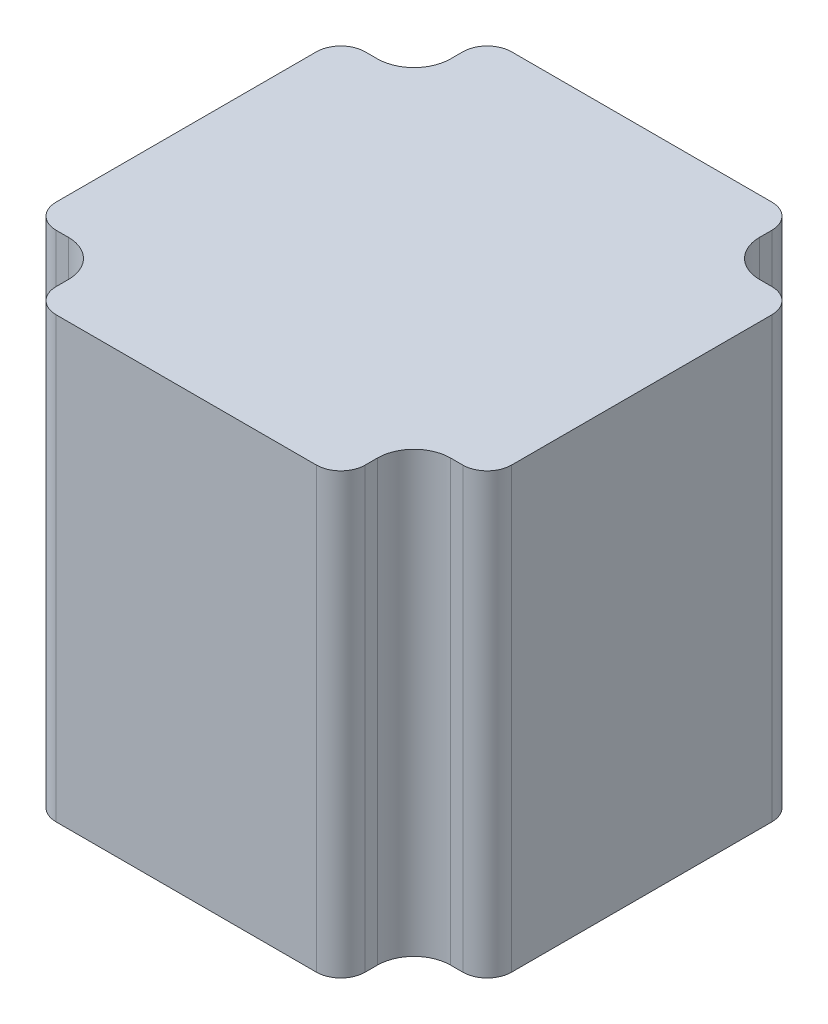
ISO-10303-21;
HEADER;
FILE_DESCRIPTION(('STEP AP214'),'2;1');
FILE_NAME('part.step','',(''),(''),'','','');
FILE_SCHEMA(('AUTOMOTIVE_DESIGN { 1 0 10303 214 1 1 1 1 }'));
ENDSEC;
DATA;
#1=APPLICATION_CONTEXT('core data for automotive mechanical design processes');
#2=APPLICATION_PROTOCOL_DEFINITION('international standard','automotive_design',2000,#1);
#3=PRODUCT_CONTEXT('',#1,'mechanical');
#4=PRODUCT('Part','Part','',(#3));
#5=PRODUCT_RELATED_PRODUCT_CATEGORY('part','',(#4));
#6=PRODUCT_DEFINITION_FORMATION('','',#4);
#7=PRODUCT_DEFINITION_CONTEXT('part definition',#1,'design');
#8=PRODUCT_DEFINITION('design','',#6,#7);
#9=PRODUCT_DEFINITION_SHAPE('','',#8);
#10=(LENGTH_UNIT() NAMED_UNIT(*) SI_UNIT(.MILLI.,.METRE.));
#11=(NAMED_UNIT(*) PLANE_ANGLE_UNIT() SI_UNIT($,.RADIAN.));
#12=(NAMED_UNIT(*) SI_UNIT($,.STERADIAN.) SOLID_ANGLE_UNIT());
#13=UNCERTAINTY_MEASURE_WITH_UNIT(LENGTH_MEASURE(1.E-05),#10,'distance_accuracy_value','');
#14=(GEOMETRIC_REPRESENTATION_CONTEXT(3) GLOBAL_UNCERTAINTY_ASSIGNED_CONTEXT((#13)) GLOBAL_UNIT_ASSIGNED_CONTEXT((#10,
#11,#12)) REPRESENTATION_CONTEXT('',''));
#15=CARTESIAN_POINT('',(0.,0.,0.));
#16=DIRECTION('',(0.,0.,1.));
#17=DIRECTION('',(1.,0.,0.));
#18=AXIS2_PLACEMENT_3D('',#15,#16,#17);
#19=CARTESIAN_POINT('',(81.,-5.6899999999982,69.18));
#20=DIRECTION('',(0.,0.,-1.));
#21=DIRECTION('',(0.,-1.,0.));
#22=AXIS2_PLACEMENT_3D('',#19,#20,#21);
#23=PLANE('',#22);
#24=DIRECTION('',(0.,-1.,0.));
#25=VECTOR('',#24,1.);
#26=CARTESIAN_POINT('',(69.5,17.3100000000018,69.18));
#27=LINE('',#26,#25);
#28=CARTESIAN_POINT('',(69.5,89.2100000000019,69.18));
#29=VERTEX_POINT('',#28);
#30=CARTESIAN_POINT('',(69.5,51.8100000000018,69.18));
#31=VERTEX_POINT('',#30);
#32=EDGE_CURVE('E714',#29,#31,#27,.T.);
#33=ORIENTED_EDGE('',*,*,#32,.F.);
#34=CARTESIAN_POINT('',(69.5000000000001,105.810000000002,69.18));
#35=DIRECTION('',(0.,-1.,0.));
#36=VECTOR('',#35,1.);
#37=LINE('',#34,#36);
#38=CARTESIAN_POINT('',(69.5,105.810000000002,69.18));
#39=VERTEX_POINT('',#38);
#40=EDGE_CURVE('E442',#39,#29,#37,.T.);
#41=ORIENTED_EDGE('',*,*,#40,.F.);
#42=DIRECTION('',(-1.,0.,0.));
#43=VECTOR('',#42,1.);
#44=CARTESIAN_POINT('',(91.25,105.810000000002,69.18));
#45=LINE('',#44,#43);
#46=CARTESIAN_POINT('',(101.5,105.810000000002,69.18));
#47=VERTEX_POINT('',#46);
#48=EDGE_CURVE('E552',#47,#39,#45,.T.);
#49=ORIENTED_EDGE('',*,*,#48,.F.);
#50=CARTESIAN_POINT('',(101.5,105.810000000002,69.1800000000001));
#51=DIRECTION('',(0.,-1.,0.));
#52=VECTOR('',#51,1.);
#53=LINE('',#50,#52);
#54=CARTESIAN_POINT('',(101.5,89.2100000000018,69.18));
#55=VERTEX_POINT('',#54);
#56=EDGE_CURVE('E473',#47,#55,#53,.T.);
#57=ORIENTED_EDGE('',*,*,#56,.T.);
#58=DIRECTION('',(0.,1.,0.));
#59=VECTOR('',#58,1.);
#60=CARTESIAN_POINT('',(101.5,17.3100000000017,69.18));
#61=LINE('',#60,#59);
#62=CARTESIAN_POINT('',(101.5,51.8100000000017,69.18));
#63=VERTEX_POINT('',#62);
#64=EDGE_CURVE('E718',#63,#55,#61,.T.);
#65=ORIENTED_EDGE('',*,*,#64,.F.);
#66=DIRECTION('',(1.,0.,0.));
#67=VECTOR('',#66,1.);
#68=CARTESIAN_POINT('',(91.25,51.8100000000018,69.18));
#69=LINE('',#68,#67);
#70=EDGE_CURVE('E143',#31,#63,#69,.T.);
#71=ORIENTED_EDGE('',*,*,#70,.F.);
#72=EDGE_LOOP('',(#33,#41,#49,#57,#65,#71));
#73=FACE_BOUND('',#72,.T.);
#74=ADVANCED_FACE('F17',(#73),#23,.T.);
#75=CARTESIAN_POINT('',(104.5,40.3100000000017,122.93));
#76=DIRECTION('',(1.,0.,0.));
#77=DIRECTION('',(0.,1.,0.));
#78=AXIS2_PLACEMENT_3D('',#75,#76,#77);
#79=PLANE('',#78);
#80=DIRECTION('',(0.,-1.,0.));
#81=VECTOR('',#80,1.);
#82=CARTESIAN_POINT('',(104.5,17.3100000000017,72.18));
#83=LINE('',#82,#81);
#84=CARTESIAN_POINT('',(104.5,105.810000000002,72.18));
#85=VERTEX_POINT('',#84);
#86=CARTESIAN_POINT('',(104.5,51.8100000000017,72.18));
#87=VERTEX_POINT('',#86);
#88=EDGE_CURVE('E11',#85,#87,#83,.T.);
#89=ORIENTED_EDGE('',*,*,#88,.F.);
#90=DIRECTION('',(0.,0.,-1.));
#91=VECTOR('',#90,1.);
#92=CARTESIAN_POINT('',(104.5,105.810000000002,122.18));
#93=LINE('',#92,#91);
#94=CARTESIAN_POINT('',(104.5,105.810000000002,73.68));
#95=VERTEX_POINT('',#94);
#96=EDGE_CURVE('E546',#95,#85,#93,.T.);
#97=ORIENTED_EDGE('',*,*,#96,.F.);
#98=DIRECTION('',(0.,1.,0.));
#99=VECTOR('',#98,1.);
#100=CARTESIAN_POINT('',(104.5,40.3100000000017,73.68));
#101=LINE('',#100,#99);
#102=CARTESIAN_POINT('',(104.5,51.8100000000017,73.68));
#103=VERTEX_POINT('',#102);
#104=EDGE_CURVE('E30',#103,#95,#101,.T.);
#105=ORIENTED_EDGE('',*,*,#104,.F.);
#106=DIRECTION('',(0.,0.,1.));
#107=VECTOR('',#106,1.);
#108=CARTESIAN_POINT('',(104.5,51.8100000000017,122.18));
#109=LINE('',#108,#107);
#110=EDGE_CURVE('E126',#87,#103,#109,.T.);
#111=ORIENTED_EDGE('',*,*,#110,.F.);
#112=EDGE_LOOP('',(#89,#97,#105,#111));
#113=FACE_BOUND('',#112,.T.);
#114=ADVANCED_FACE('F385',(#113),#79,.T.);
#115=CARTESIAN_POINT('',(109.,40.3100000000017,73.68));
#116=DIRECTION('',(0.,-1.,0.));
#117=DIRECTION('',(0.,0.,-1.));
#118=AXIS2_PLACEMENT_3D('',#115,#116,#117);
#119=CYLINDRICAL_SURFACE('',#118,4.5);
#120=ORIENTED_EDGE('',*,*,#104,.T.);
#121=CARTESIAN_POINT('',(109.,105.810000000002,73.68));
#122=DIRECTION('',(0.,-1.,0.));
#123=DIRECTION('',(0.,0.,-1.));
#124=AXIS2_PLACEMENT_3D('',#121,#122,#123);
#125=CIRCLE('',#124,4.5);
#126=CARTESIAN_POINT('',(109.,105.810000000002,78.18));
#127=VERTEX_POINT('',#126);
#128=EDGE_CURVE('E543',#127,#95,#125,.T.);
#129=ORIENTED_EDGE('',*,*,#128,.F.);
#130=DIRECTION('',(0.,1.,0.));
#131=VECTOR('',#130,1.);
#132=CARTESIAN_POINT('',(109.,40.3100000000017,78.18));
#133=LINE('',#132,#131);
#134=CARTESIAN_POINT('',(109.,51.8100000000017,78.18));
#135=VERTEX_POINT('',#134);
#136=EDGE_CURVE('E80',#135,#127,#133,.T.);
#137=ORIENTED_EDGE('',*,*,#136,.F.);
#138=CARTESIAN_POINT('',(109.,51.8100000000017,73.68));
#139=DIRECTION('',(0.,1.,0.));
#140=DIRECTION('',(0.,0.,-1.));
#141=AXIS2_PLACEMENT_3D('',#138,#139,#140);
#142=CIRCLE('',#141,4.5);
#143=EDGE_CURVE('E117',#103,#135,#142,.T.);
#144=ORIENTED_EDGE('',*,*,#143,.F.);
#145=EDGE_LOOP('',(#120,#129,#137,#144));
#146=FACE_BOUND('',#145,.T.);
#147=ADVANCED_FACE('F383',(#146),#119,.F.);
#148=CARTESIAN_POINT('',(59.75,40.3100000000019,78.18));
#149=DIRECTION('',(0.,0.,-1.));
#150=DIRECTION('',(0.,-1.,0.));
#151=AXIS2_PLACEMENT_3D('',#148,#149,#150);
#152=PLANE('',#151);
#153=ORIENTED_EDGE('',*,*,#136,.T.);
#154=DIRECTION('',(-1.,0.,0.));
#155=VECTOR('',#154,1.);
#156=CARTESIAN_POINT('',(101.5,105.810000000002,78.18));
#157=LINE('',#156,#155);
#158=CARTESIAN_POINT('',(110.5,105.810000000002,78.18));
#159=VERTEX_POINT('',#158);
#160=EDGE_CURVE('E111',#159,#127,#157,.T.);
#161=ORIENTED_EDGE('',*,*,#160,.F.);
#162=DIRECTION('',(0.,1.,0.));
#163=VECTOR('',#162,1.);
#164=CARTESIAN_POINT('',(110.5,55.3100000000017,78.18));
#165=LINE('',#164,#163);
#166=CARTESIAN_POINT('',(110.5,51.8100000000017,78.18));
#167=VERTEX_POINT('',#166);
#168=EDGE_CURVE('E93',#167,#159,#165,.T.);
#169=ORIENTED_EDGE('',*,*,#168,.F.);
#170=DIRECTION('',(1.,0.,0.));
#171=VECTOR('',#170,1.);
#172=CARTESIAN_POINT('',(101.5,51.8100000000017,78.18));
#173=LINE('',#172,#171);
#174=EDGE_CURVE('E108',#135,#167,#173,.T.);
#175=ORIENTED_EDGE('',*,*,#174,.F.);
#176=EDGE_LOOP('',(#153,#161,#169,#175));
#177=FACE_BOUND('',#176,.T.);
#178=ADVANCED_FACE('F107',(#177),#152,.T.);
#179=CARTESIAN_POINT('',(113.5,70.3100000000017,125.18));
#180=DIRECTION('',(1.,0.,0.));
#181=DIRECTION('',(0.,-1.,0.));
#182=AXIS2_PLACEMENT_3D('',#179,#180,#181);
#183=PLANE('',#182);
#184=DIRECTION('',(0.,-1.,0.));
#185=VECTOR('',#184,1.);
#186=CARTESIAN_POINT('',(113.5,55.3100000000017,81.18));
#187=LINE('',#186,#185);
#188=CARTESIAN_POINT('',(113.5,89.2100000000017,81.18));
#189=VERTEX_POINT('',#188);
#190=CARTESIAN_POINT('',(113.5,51.8100000000017,81.18));
#191=VERTEX_POINT('',#190);
#192=EDGE_CURVE('E98',#189,#191,#187,.T.);
#193=ORIENTED_EDGE('',*,*,#192,.F.);
#194=CARTESIAN_POINT('',(113.5,105.810000000002,81.18));
#195=DIRECTION('',(0.,-1.,0.));
#196=VECTOR('',#195,1.);
#197=LINE('',#194,#196);
#198=CARTESIAN_POINT('',(113.5,105.810000000002,81.18));
#199=VERTEX_POINT('',#198);
#200=EDGE_CURVE('E762',#199,#189,#197,.T.);
#201=ORIENTED_EDGE('',*,*,#200,.F.);
#202=DIRECTION('',(0.,0.,-1.));
#203=VECTOR('',#202,1.);
#204=CARTESIAN_POINT('',(113.5,105.810000000002,123.68));
#205=LINE('',#204,#203);
#206=CARTESIAN_POINT('',(113.5,105.810000000002,113.18));
#207=VERTEX_POINT('',#206);
#208=EDGE_CURVE('E531',#207,#199,#205,.T.);
#209=ORIENTED_EDGE('',*,*,#208,.F.);
#210=CARTESIAN_POINT('',(113.5,105.810000000002,113.18));
#211=DIRECTION('',(0.,-1.,0.));
#212=VECTOR('',#211,1.);
#213=LINE('',#210,#212);
#214=CARTESIAN_POINT('',(113.5,89.2100000000017,113.18));
#215=VERTEX_POINT('',#214);
#216=EDGE_CURVE('E763',#207,#215,#213,.T.);
#217=ORIENTED_EDGE('',*,*,#216,.T.);
#218=DIRECTION('',(0.,1.,0.));
#219=VECTOR('',#218,1.);
#220=CARTESIAN_POINT('',(113.5,55.3100000000017,113.18));
#221=LINE('',#220,#219);
#222=CARTESIAN_POINT('',(113.5,51.8100000000017,113.18));
#223=VERTEX_POINT('',#222);
#224=EDGE_CURVE('E891',#223,#215,#221,.T.);
#225=ORIENTED_EDGE('',*,*,#224,.F.);
#226=DIRECTION('',(0.,0.,1.));
#227=VECTOR('',#226,1.);
#228=CARTESIAN_POINT('',(113.5,51.8100000000017,123.68));
#229=LINE('',#228,#227);
#230=EDGE_CURVE('E119',#191,#223,#229,.T.);
#231=ORIENTED_EDGE('',*,*,#230,.F.);
#232=EDGE_LOOP('',(#193,#201,#209,#217,#225,#231));
#233=FACE_BOUND('',#232,.T.);
#234=ADVANCED_FACE('F382',(#233),#183,.T.);
#235=CARTESIAN_POINT('',(59.75,40.3100000000019,116.18));
#236=DIRECTION('',(0.,0.,1.));
#237=DIRECTION('',(0.,1.,0.));
#238=AXIS2_PLACEMENT_3D('',#235,#236,#237);
#239=PLANE('',#238);
#240=DIRECTION('',(0.,-1.,0.));
#241=VECTOR('',#240,1.);
#242=CARTESIAN_POINT('',(110.5,55.3100000000017,116.18));
#243=LINE('',#242,#241);
#244=CARTESIAN_POINT('',(110.5,105.810000000002,116.18));
#245=VERTEX_POINT('',#244);
#246=CARTESIAN_POINT('',(110.5,51.8100000000017,116.18));
#247=VERTEX_POINT('',#246);
#248=EDGE_CURVE('E112',#245,#247,#243,.T.);
#249=ORIENTED_EDGE('',*,*,#248,.F.);
#250=DIRECTION('',(1.,0.,0.));
#251=VECTOR('',#250,1.);
#252=CARTESIAN_POINT('',(101.5,105.810000000002,116.18));
#253=LINE('',#252,#251);
#254=CARTESIAN_POINT('',(109.,105.810000000002,116.18));
#255=VERTEX_POINT('',#254);
#256=EDGE_CURVE('E523',#255,#245,#253,.T.);
#257=ORIENTED_EDGE('',*,*,#256,.F.);
#258=DIRECTION('',(0.,1.,0.));
#259=VECTOR('',#258,1.);
#260=CARTESIAN_POINT('',(109.,40.3100000000017,116.18));
#261=LINE('',#260,#259);
#262=CARTESIAN_POINT('',(109.,51.8100000000017,116.18));
#263=VERTEX_POINT('',#262);
#264=EDGE_CURVE('E132',#263,#255,#261,.T.);
#265=ORIENTED_EDGE('',*,*,#264,.F.);
#266=DIRECTION('',(-1.,0.,0.));
#267=VECTOR('',#266,1.);
#268=CARTESIAN_POINT('',(101.5,51.8100000000017,116.18));
#269=LINE('',#268,#267);
#270=EDGE_CURVE('E124',#247,#263,#269,.T.);
#271=ORIENTED_EDGE('',*,*,#270,.F.);
#272=EDGE_LOOP('',(#249,#257,#265,#271));
#273=FACE_BOUND('',#272,.T.);
#274=ADVANCED_FACE('F868',(#273),#239,.T.);
#275=CARTESIAN_POINT('',(109.,40.3100000000017,120.68));
#276=DIRECTION('',(0.,-1.,0.));
#277=DIRECTION('',(1.,0.,0.));
#278=AXIS2_PLACEMENT_3D('',#275,#276,#277);
#279=CYLINDRICAL_SURFACE('',#278,4.5);
#280=ORIENTED_EDGE('',*,*,#264,.T.);
#281=CARTESIAN_POINT('',(109.,105.810000000002,120.68));
#282=DIRECTION('',(0.,-1.,0.));
#283=DIRECTION('',(1.,0.,0.));
#284=AXIS2_PLACEMENT_3D('',#281,#282,#283);
#285=CIRCLE('',#284,4.5);
#286=CARTESIAN_POINT('',(104.5,105.810000000002,120.68));
#287=VERTEX_POINT('',#286);
#288=EDGE_CURVE('E518',#287,#255,#285,.T.);
#289=ORIENTED_EDGE('',*,*,#288,.F.);
#290=CARTESIAN_POINT('',(104.5,105.810000000002,120.68));
#291=DIRECTION('',(0.,-1.,0.));
#292=VECTOR('',#291,1.);
#293=LINE('',#290,#292);
#294=CARTESIAN_POINT('',(104.5,89.2100000000017,120.68));
#295=VERTEX_POINT('',#294);
#296=EDGE_CURVE('E841',#287,#295,#293,.T.);
#297=ORIENTED_EDGE('',*,*,#296,.T.);
#298=DIRECTION('',(0.,1.,0.));
#299=VECTOR('',#298,1.);
#300=CARTESIAN_POINT('',(104.5,40.3100000000017,120.68));
#301=LINE('',#300,#299);
#302=CARTESIAN_POINT('',(104.5,51.8100000000017,120.68));
#303=VERTEX_POINT('',#302);
#304=EDGE_CURVE('E43',#303,#295,#301,.T.);
#305=ORIENTED_EDGE('',*,*,#304,.F.);
#306=CARTESIAN_POINT('',(109.,51.8100000000017,120.68));
#307=DIRECTION('',(0.,1.,0.));
#308=DIRECTION('',(1.,0.,0.));
#309=AXIS2_PLACEMENT_3D('',#306,#307,#308);
#310=CIRCLE('',#309,4.5);
#311=EDGE_CURVE('E138',#263,#303,#310,.T.);
#312=ORIENTED_EDGE('',*,*,#311,.F.);
#313=EDGE_LOOP('',(#280,#289,#297,#305,#312));
#314=FACE_BOUND('',#313,.T.);
#315=ADVANCED_FACE('F801',(#314),#279,.F.);
#316=ORIENTED_EDGE('',*,*,#304,.T.);
#317=ORIENTED_EDGE('',*,*,#296,.F.);
#318=DIRECTION('',(0.,0.,-1.));
#319=VECTOR('',#318,1.);
#320=CARTESIAN_POINT('',(104.5,105.810000000002,122.555));
#321=LINE('',#320,#319);
#322=CARTESIAN_POINT('',(104.5,105.810000000002,122.18));
#323=VERTEX_POINT('',#322);
#324=EDGE_CURVE('E510',#323,#287,#321,.T.);
#325=ORIENTED_EDGE('',*,*,#324,.F.);
#326=CARTESIAN_POINT('',(104.5,105.810000000002,122.18));
#327=DIRECTION('',(0.,-1.,0.));
#328=VECTOR('',#327,1.);
#329=LINE('',#326,#328);
#330=CARTESIAN_POINT('',(104.5,89.2100000000017,122.18));
#331=VERTEX_POINT('',#330);
#332=EDGE_CURVE('E816',#323,#331,#329,.T.);
#333=ORIENTED_EDGE('',*,*,#332,.T.);
#334=DIRECTION('',(0.,1.,0.));
#335=VECTOR('',#334,1.);
#336=CARTESIAN_POINT('',(104.5,17.3100000000017,122.18));
#337=LINE('',#336,#335);
#338=CARTESIAN_POINT('',(104.5,51.8100000000017,122.18));
#339=VERTEX_POINT('',#338);
#340=EDGE_CURVE('E736',#339,#331,#337,.T.);
#341=ORIENTED_EDGE('',*,*,#340,.F.);
#342=DIRECTION('',(0.,0.,1.));
#343=VECTOR('',#342,1.);
#344=CARTESIAN_POINT('',(104.5,51.8100000000017,122.555));
#345=LINE('',#344,#343);
#346=EDGE_CURVE('E1026',#303,#339,#345,.T.);
#347=ORIENTED_EDGE('',*,*,#346,.F.);
#348=EDGE_LOOP('',(#316,#317,#325,#333,#341,#347));
#349=FACE_BOUND('',#348,.T.);
#350=ADVANCED_FACE('F1044',(#349),#79,.T.);
#351=CARTESIAN_POINT('',(101.5,51.8100000000017,122.18));
#352=DIRECTION('',(0.,1.,0.));
#353=DIRECTION('',(0.707106781186541,0.,0.707106781186554));
#354=AXIS2_PLACEMENT_3D('',#351,#352,#353);
#355=PLANE('',#354);
#356=CARTESIAN_POINT('',(69.5,51.8100000000018,122.18));
#357=DIRECTION('',(0.,-1.,0.));
#358=DIRECTION('',(-0.707106781186551,0.,0.707106781186544));
#359=AXIS2_PLACEMENT_3D('',#356,#357,#358);
#360=CIRCLE('',#359,3.);
#361=CARTESIAN_POINT('',(69.5,51.8100000000018,125.18));
#362=VERTEX_POINT('',#361);
#363=CARTESIAN_POINT('',(66.5,51.8100000000019,122.18));
#364=VERTEX_POINT('',#363);
#365=EDGE_CURVE('E638',#362,#364,#360,.T.);
#366=ORIENTED_EDGE('',*,*,#365,.T.);
#367=DIRECTION('',(0.,0.,-1.));
#368=VECTOR('',#367,1.);
#369=CARTESIAN_POINT('',(66.5,51.8100000000019,122.555));
#370=LINE('',#369,#368);
#371=CARTESIAN_POINT('',(66.5,51.8100000000018,120.68));
#372=VERTEX_POINT('',#371);
#373=EDGE_CURVE('E632',#364,#372,#370,.T.);
#374=ORIENTED_EDGE('',*,*,#373,.T.);
#375=CARTESIAN_POINT('',(62.,51.8100000000019,120.68));
#376=DIRECTION('',(0.,1.,0.));
#377=DIRECTION('',(0.,0.,1.));
#378=AXIS2_PLACEMENT_3D('',#375,#376,#377);
#379=CIRCLE('',#378,4.5);
#380=CARTESIAN_POINT('',(62.,51.8100000000019,116.18));
#381=VERTEX_POINT('',#380);
#382=EDGE_CURVE('E612',#372,#381,#379,.T.);
#383=ORIENTED_EDGE('',*,*,#382,.T.);
#384=DIRECTION('',(-1.,0.,0.));
#385=VECTOR('',#384,1.);
#386=CARTESIAN_POINT('',(80.625,51.8100000000018,116.18));
#387=LINE('',#386,#385);
#388=CARTESIAN_POINT('',(60.5,51.8100000000019,116.18));
#389=VERTEX_POINT('',#388);
#390=EDGE_CURVE('E624',#381,#389,#387,.T.);
#391=ORIENTED_EDGE('',*,*,#390,.T.);
#392=CARTESIAN_POINT('',(60.5,51.8100000000019,113.18));
#393=DIRECTION('',(0.,-1.,0.));
#394=DIRECTION('',(-0.707106781186554,0.,0.707106781186541));
#395=AXIS2_PLACEMENT_3D('',#392,#393,#394);
#396=CIRCLE('',#395,3.);
#397=CARTESIAN_POINT('',(57.5,51.8100000000019,113.18));
#398=VERTEX_POINT('',#397);
#399=EDGE_CURVE('E613',#389,#398,#396,.T.);
#400=ORIENTED_EDGE('',*,*,#399,.T.);
#401=DIRECTION('',(0.,0.,-1.));
#402=VECTOR('',#401,1.);
#403=CARTESIAN_POINT('',(57.5,51.8100000000019,123.68));
#404=LINE('',#403,#402);
#405=CARTESIAN_POINT('',(57.5,51.8100000000019,81.18));
#406=VERTEX_POINT('',#405);
#407=EDGE_CURVE('E631',#398,#406,#404,.T.);
#408=ORIENTED_EDGE('',*,*,#407,.T.);
#409=CARTESIAN_POINT('',(60.5,51.8100000000019,81.18));
#410=DIRECTION('',(0.,-1.,0.));
#411=DIRECTION('',(-0.707106781186539,0.,-0.707106781186556));
#412=AXIS2_PLACEMENT_3D('',#409,#410,#411);
#413=CIRCLE('',#412,3.);
#414=CARTESIAN_POINT('',(60.5,51.8100000000019,78.18));
#415=VERTEX_POINT('',#414);
#416=EDGE_CURVE('E639',#406,#415,#413,.T.);
#417=ORIENTED_EDGE('',*,*,#416,.T.);
#418=DIRECTION('',(1.,0.,0.));
#419=VECTOR('',#418,1.);
#420=CARTESIAN_POINT('',(80.625,51.8100000000018,78.18));
#421=LINE('',#420,#419);
#422=CARTESIAN_POINT('',(62.,51.8100000000019,78.18));
#423=VERTEX_POINT('',#422);
#424=EDGE_CURVE('E151',#415,#423,#421,.T.);
#425=ORIENTED_EDGE('',*,*,#424,.T.);
#426=CARTESIAN_POINT('',(62.,51.8100000000019,73.68));
#427=DIRECTION('',(0.,1.,0.));
#428=DIRECTION('',(-1.,0.,0.));
#429=AXIS2_PLACEMENT_3D('',#426,#427,#428);
#430=CIRCLE('',#429,4.5);
#431=CARTESIAN_POINT('',(66.5,51.8100000000019,73.68));
#432=VERTEX_POINT('',#431);
#433=EDGE_CURVE('E147',#423,#432,#430,.T.);
#434=ORIENTED_EDGE('',*,*,#433,.T.);
#435=DIRECTION('',(0.,0.,-1.));
#436=VECTOR('',#435,1.);
#437=CARTESIAN_POINT('',(66.5,51.8100000000018,122.18));
#438=LINE('',#437,#436);
#439=CARTESIAN_POINT('',(66.5,51.8100000000019,72.18));
#440=VERTEX_POINT('',#439);
#441=EDGE_CURVE('E139',#432,#440,#438,.T.);
#442=ORIENTED_EDGE('',*,*,#441,.T.);
#443=CARTESIAN_POINT('',(69.5,51.8100000000018,72.18));
#444=DIRECTION('',(0.,-1.,0.));
#445=DIRECTION('',(-0.707106781186544,0.,-0.707106781186551));
#446=AXIS2_PLACEMENT_3D('',#443,#444,#445);
#447=CIRCLE('',#446,3.);
#448=EDGE_CURVE('E696',#440,#31,#447,.T.);
#449=ORIENTED_EDGE('',*,*,#448,.T.);
#450=ORIENTED_EDGE('',*,*,#70,.T.);
#451=CARTESIAN_POINT('',(101.5,51.8100000000017,72.18));
#452=DIRECTION('',(0.,-1.,0.));
#453=DIRECTION('',(0.707106781186551,0.,-0.707106781186544));
#454=AXIS2_PLACEMENT_3D('',#451,#452,#453);
#455=CIRCLE('',#454,3.);
#456=EDGE_CURVE('E715',#63,#87,#455,.T.);
#457=ORIENTED_EDGE('',*,*,#456,.T.);
#458=ORIENTED_EDGE('',*,*,#110,.T.);
#459=ORIENTED_EDGE('',*,*,#143,.T.);
#460=ORIENTED_EDGE('',*,*,#174,.T.);
#461=CARTESIAN_POINT('',(110.5,51.8100000000017,81.18));
#462=DIRECTION('',(0.,-1.,0.));
#463=DIRECTION('',(0.707106781186557,0.,-0.707106781186538));
#464=AXIS2_PLACEMENT_3D('',#461,#462,#463);
#465=CIRCLE('',#464,3.);
#466=EDGE_CURVE('E88',#167,#191,#465,.T.);
#467=ORIENTED_EDGE('',*,*,#466,.T.);
#468=ORIENTED_EDGE('',*,*,#230,.T.);
#469=CARTESIAN_POINT('',(110.5,51.8100000000017,113.18));
#470=DIRECTION('',(0.,-1.,0.));
#471=DIRECTION('',(0.707106781186544,0.,0.707106781186551));
#472=AXIS2_PLACEMENT_3D('',#469,#470,#471);
#473=CIRCLE('',#472,3.);
#474=EDGE_CURVE('E103',#223,#247,#473,.T.);
#475=ORIENTED_EDGE('',*,*,#474,.T.);
#476=ORIENTED_EDGE('',*,*,#270,.T.);
#477=ORIENTED_EDGE('',*,*,#311,.T.);
#478=ORIENTED_EDGE('',*,*,#346,.T.);
#479=CARTESIAN_POINT('',(101.5,51.8100000000017,122.18));
#480=DIRECTION('',(0.,-1.,0.));
#481=DIRECTION('',(0.707106781186541,0.,0.707106781186554));
#482=AXIS2_PLACEMENT_3D('',#479,#480,#481);
#483=CIRCLE('',#482,3.);
#484=CARTESIAN_POINT('',(101.5,51.8100000000017,125.18));
#485=VERTEX_POINT('',#484);
#486=EDGE_CURVE('E934',#339,#485,#483,.T.);
#487=ORIENTED_EDGE('',*,*,#486,.T.);
#488=DIRECTION('',(-1.,0.,0.));
#489=VECTOR('',#488,1.);
#490=CARTESIAN_POINT('',(91.25,51.8100000000018,125.18));
#491=LINE('',#490,#489);
#492=EDGE_CURVE('E690',#485,#362,#491,.T.);
#493=ORIENTED_EDGE('',*,*,#492,.T.);
#494=EDGE_LOOP('',(#366,#374,#383,#391,#400,#408,#417,#425,#434,#442,#449,#450,#457,#458,#459,
#460,#467,#468,#475,#476,#477,#478,#487,#493));
#495=FACE_BOUND('',#494,.T.);
#496=ADVANCED_FACE('F115',(#495),#355,.F.);
#497=CARTESIAN_POINT('',(66.5,40.3100000000019,122.93));
#498=DIRECTION('',(-1.,0.,0.));
#499=DIRECTION('',(0.,-1.,0.));
#500=AXIS2_PLACEMENT_3D('',#497,#498,#499);
#501=PLANE('',#500);
#502=DIRECTION('',(0.,1.,0.));
#503=VECTOR('',#502,1.);
#504=CARTESIAN_POINT('',(66.5,40.3100000000019,73.68));
#505=LINE('',#504,#503);
#506=CARTESIAN_POINT('',(66.5,105.810000000002,73.68));
#507=VERTEX_POINT('',#506);
#508=EDGE_CURVE('E148',#432,#507,#505,.T.);
#509=ORIENTED_EDGE('',*,*,#508,.T.);
#510=DIRECTION('',(0.,0.,1.));
#511=VECTOR('',#510,1.);
#512=CARTESIAN_POINT('',(66.5,105.810000000002,122.18));
#513=LINE('',#512,#511);
#514=CARTESIAN_POINT('',(66.5,105.810000000002,72.18));
#515=VERTEX_POINT('',#514);
#516=EDGE_CURVE('E562',#515,#507,#513,.T.);
#517=ORIENTED_EDGE('',*,*,#516,.F.);
#518=DIRECTION('',(0.,1.,0.));
#519=VECTOR('',#518,1.);
#520=CARTESIAN_POINT('',(66.5,17.3100000000018,72.18));
#521=LINE('',#520,#519);
#522=EDGE_CURVE('E144',#440,#515,#521,.T.);
#523=ORIENTED_EDGE('',*,*,#522,.F.);
#524=ORIENTED_EDGE('',*,*,#441,.F.);
#525=EDGE_LOOP('',(#509,#517,#523,#524));
#526=FACE_BOUND('',#525,.T.);
#527=ADVANCED_FACE('F19',(#526),#501,.T.);
#528=CARTESIAN_POINT('',(62.,40.3100000000019,73.68));
#529=DIRECTION('',(0.,-1.,0.));
#530=DIRECTION('',(-1.,0.,0.));
#531=AXIS2_PLACEMENT_3D('',#528,#529,#530);
#532=CYLINDRICAL_SURFACE('',#531,4.5);
#533=DIRECTION('',(0.,1.,0.));
#534=VECTOR('',#533,1.);
#535=CARTESIAN_POINT('',(62.,40.3100000000019,78.18));
#536=LINE('',#535,#534);
#537=CARTESIAN_POINT('',(62.,89.2100000000019,78.18));
#538=VERTEX_POINT('',#537);
#539=EDGE_CURVE('E655',#423,#538,#536,.T.);
#540=ORIENTED_EDGE('',*,*,#539,.T.);
#541=CARTESIAN_POINT('',(62.,105.810000000002,78.18));
#542=DIRECTION('',(0.,-1.,0.));
#543=VECTOR('',#542,1.);
#544=LINE('',#541,#543);
#545=CARTESIAN_POINT('',(62.,105.810000000002,78.18));
#546=VERTEX_POINT('',#545);
#547=EDGE_CURVE('E403',#546,#538,#544,.T.);
#548=ORIENTED_EDGE('',*,*,#547,.F.);
#549=CARTESIAN_POINT('',(62.,105.810000000002,73.68));
#550=DIRECTION('',(0.,-1.,0.));
#551=DIRECTION('',(-1.,0.,0.));
#552=AXIS2_PLACEMENT_3D('',#549,#550,#551);
#553=CIRCLE('',#552,4.5);
#554=EDGE_CURVE('E567',#507,#546,#553,.T.);
#555=ORIENTED_EDGE('',*,*,#554,.F.);
#556=ORIENTED_EDGE('',*,*,#508,.F.);
#557=ORIENTED_EDGE('',*,*,#433,.F.);
#558=EDGE_LOOP('',(#540,#548,#555,#556,#557));
#559=FACE_BOUND('',#558,.T.);
#560=ADVANCED_FACE('F410',(#559),#532,.F.);
#561=DIRECTION('',(0.,-1.,0.));
#562=VECTOR('',#561,1.);
#563=CARTESIAN_POINT('',(60.5,55.3100000000019,78.18));
#564=LINE('',#563,#562);
#565=CARTESIAN_POINT('',(60.5,89.2100000000019,78.18));
#566=VERTEX_POINT('',#565);
#567=EDGE_CURVE('E652',#566,#415,#564,.T.);
#568=ORIENTED_EDGE('',*,*,#567,.F.);
#569=CARTESIAN_POINT('',(60.5000000000001,105.810000000002,78.18));
#570=DIRECTION('',(0.,-1.,0.));
#571=VECTOR('',#570,1.);
#572=LINE('',#569,#571);
#573=CARTESIAN_POINT('',(60.5,105.810000000002,78.18));
#574=VERTEX_POINT('',#573);
#575=EDGE_CURVE('E355',#574,#566,#572,.T.);
#576=ORIENTED_EDGE('',*,*,#575,.F.);
#577=DIRECTION('',(-1.,0.,0.));
#578=VECTOR('',#577,1.);
#579=CARTESIAN_POINT('',(80.625,105.810000000002,78.18));
#580=LINE('',#579,#578);
#581=EDGE_CURVE('E570',#546,#574,#580,.T.);
#582=ORIENTED_EDGE('',*,*,#581,.F.);
#583=ORIENTED_EDGE('',*,*,#547,.T.);
#584=ORIENTED_EDGE('',*,*,#539,.F.);
#585=ORIENTED_EDGE('',*,*,#424,.F.);
#586=EDGE_LOOP('',(#568,#576,#582,#583,#584,#585));
#587=FACE_BOUND('',#586,.T.);
#588=ADVANCED_FACE('F384',(#587),#152,.T.);
#589=CARTESIAN_POINT('',(81.,-5.6899999999982,125.18));
#590=DIRECTION('',(0.,0.,-1.));
#591=DIRECTION('',(0.,-1.,0.));
#592=AXIS2_PLACEMENT_3D('',#589,#590,#591);
#593=PLANE('',#592);
#594=DIRECTION('',(0.,-1.,0.));
#595=VECTOR('',#594,1.);
#596=CARTESIAN_POINT('',(101.5,17.3100000000017,125.18));
#597=LINE('',#596,#595);
#598=CARTESIAN_POINT('',(101.5,89.2100000000017,125.18));
#599=VERTEX_POINT('',#598);
#600=EDGE_CURVE('E656',#599,#485,#597,.T.);
#601=ORIENTED_EDGE('',*,*,#600,.F.);
#602=CARTESIAN_POINT('',(101.5,105.810000000002,125.18));
#603=DIRECTION('',(0.,-1.,0.));
#604=VECTOR('',#603,1.);
#605=LINE('',#602,#604);
#606=CARTESIAN_POINT('',(101.5,105.810000000002,125.18));
#607=VERTEX_POINT('',#606);
#608=EDGE_CURVE('E719',#607,#599,#605,.T.);
#609=ORIENTED_EDGE('',*,*,#608,.F.);
#610=DIRECTION('',(-1.,0.,0.));
#611=VECTOR('',#610,1.);
#612=CARTESIAN_POINT('',(91.25,105.810000000002,125.18));
#613=LINE('',#612,#611);
#614=CARTESIAN_POINT('',(69.5,105.810000000002,125.18));
#615=VERTEX_POINT('',#614);
#616=EDGE_CURVE('E497',#607,#615,#613,.T.);
#617=ORIENTED_EDGE('',*,*,#616,.T.);
#618=CARTESIAN_POINT('',(69.5,105.810000000002,125.18));
#619=DIRECTION('',(0.,-1.,0.));
#620=VECTOR('',#619,1.);
#621=LINE('',#618,#620);
#622=CARTESIAN_POINT('',(69.5,89.2100000000018,125.18));
#623=VERTEX_POINT('',#622);
#624=EDGE_CURVE('E159',#615,#623,#621,.T.);
#625=ORIENTED_EDGE('',*,*,#624,.T.);
#626=DIRECTION('',(0.,1.,0.));
#627=VECTOR('',#626,1.);
#628=CARTESIAN_POINT('',(69.5,17.3100000000018,125.18));
#629=LINE('',#628,#627);
#630=EDGE_CURVE('E645',#362,#623,#629,.T.);
#631=ORIENTED_EDGE('',*,*,#630,.F.);
#632=ORIENTED_EDGE('',*,*,#492,.F.);
#633=EDGE_LOOP('',(#601,#609,#617,#625,#631,#632));
#634=FACE_BOUND('',#633,.T.);
#635=ADVANCED_FACE('F419',(#634),#593,.F.);
#636=CARTESIAN_POINT('',(57.5,70.3100000000019,125.18));
#637=DIRECTION('',(-1.,0.,0.));
#638=DIRECTION('',(0.,1.,0.));
#639=AXIS2_PLACEMENT_3D('',#636,#637,#638);
#640=PLANE('',#639);
#641=DIRECTION('',(0.,-1.,0.));
#642=VECTOR('',#641,1.);
#643=CARTESIAN_POINT('',(57.5,55.3100000000019,113.18));
#644=LINE('',#643,#642);
#645=CARTESIAN_POINT('',(57.5,89.2100000000019,113.18));
#646=VERTEX_POINT('',#645);
#647=EDGE_CURVE('E642',#646,#398,#644,.T.);
#648=ORIENTED_EDGE('',*,*,#647,.F.);
#649=CARTESIAN_POINT('',(57.5000000000002,105.810000000002,113.18));
#650=DIRECTION('',(0.,-1.,0.));
#651=VECTOR('',#650,1.);
#652=LINE('',#649,#651);
#653=CARTESIAN_POINT('',(57.5,105.810000000002,113.18));
#654=VERTEX_POINT('',#653);
#655=EDGE_CURVE('E301',#654,#646,#652,.T.);
#656=ORIENTED_EDGE('',*,*,#655,.F.);
#657=DIRECTION('',(0.,0.,1.));
#658=VECTOR('',#657,1.);
#659=CARTESIAN_POINT('',(57.5,105.810000000002,123.68));
#660=LINE('',#659,#658);
#661=CARTESIAN_POINT('',(57.5,105.810000000002,81.18));
#662=VERTEX_POINT('',#661);
#663=EDGE_CURVE('E580',#662,#654,#660,.T.);
#664=ORIENTED_EDGE('',*,*,#663,.F.);
#665=CARTESIAN_POINT('',(57.5000000000004,105.810000000002,81.18));
#666=DIRECTION('',(0.,-1.,0.));
#667=VECTOR('',#666,1.);
#668=LINE('',#665,#667);
#669=CARTESIAN_POINT('',(57.5,89.2100000000019,81.18));
#670=VERTEX_POINT('',#669);
#671=EDGE_CURVE('E328',#662,#670,#668,.T.);
#672=ORIENTED_EDGE('',*,*,#671,.T.);
#673=DIRECTION('',(0.,1.,0.));
#674=VECTOR('',#673,1.);
#675=CARTESIAN_POINT('',(57.5,55.3100000000019,81.18));
#676=LINE('',#675,#674);
#677=EDGE_CURVE('E635',#406,#670,#676,.T.);
#678=ORIENTED_EDGE('',*,*,#677,.F.);
#679=ORIENTED_EDGE('',*,*,#407,.F.);
#680=EDGE_LOOP('',(#648,#656,#664,#672,#678,#679));
#681=FACE_BOUND('',#680,.T.);
#682=ADVANCED_FACE('F181',(#681),#640,.T.);
#683=DIRECTION('',(0.,-1.,0.));
#684=VECTOR('',#683,1.);
#685=CARTESIAN_POINT('',(66.5,17.3100000000019,122.18));
#686=LINE('',#685,#684);
#687=CARTESIAN_POINT('',(66.5,89.2100000000019,122.18));
#688=VERTEX_POINT('',#687);
#689=EDGE_CURVE('E627',#688,#364,#686,.T.);
#690=ORIENTED_EDGE('',*,*,#689,.F.);
#691=CARTESIAN_POINT('',(66.5000000000003,105.810000000002,122.18));
#692=DIRECTION('',(0.,-1.,0.));
#693=VECTOR('',#692,1.);
#694=LINE('',#691,#693);
#695=CARTESIAN_POINT('',(66.5,105.810000000002,122.18));
#696=VERTEX_POINT('',#695);
#697=EDGE_CURVE('E198',#696,#688,#694,.T.);
#698=ORIENTED_EDGE('',*,*,#697,.F.);
#699=DIRECTION('',(0.,0.,1.));
#700=VECTOR('',#699,1.);
#701=CARTESIAN_POINT('',(66.5,105.810000000002,122.555));
#702=LINE('',#701,#700);
#703=CARTESIAN_POINT('',(66.5,105.810000000002,120.68));
#704=VERTEX_POINT('',#703);
#705=EDGE_CURVE('E600',#704,#696,#702,.T.);
#706=ORIENTED_EDGE('',*,*,#705,.F.);
#707=CARTESIAN_POINT('',(66.5000000000002,105.810000000002,120.68));
#708=DIRECTION('',(0.,-1.,0.));
#709=VECTOR('',#708,1.);
#710=LINE('',#707,#709);
#711=CARTESIAN_POINT('',(66.5,89.2100000000019,120.68));
#712=VERTEX_POINT('',#711);
#713=EDGE_CURVE('E212',#704,#712,#710,.T.);
#714=ORIENTED_EDGE('',*,*,#713,.T.);
#715=DIRECTION('',(0.,1.,0.));
#716=VECTOR('',#715,1.);
#717=CARTESIAN_POINT('',(66.5,40.3100000000019,120.68));
#718=LINE('',#717,#716);
#719=EDGE_CURVE('E616',#372,#712,#718,.T.);
#720=ORIENTED_EDGE('',*,*,#719,.F.);
#721=ORIENTED_EDGE('',*,*,#373,.F.);
#722=EDGE_LOOP('',(#690,#698,#706,#714,#720,#721));
#723=FACE_BOUND('',#722,.T.);
#724=ADVANCED_FACE('F961',(#723),#501,.T.);
#725=DIRECTION('',(0.,1.,0.));
#726=VECTOR('',#725,1.);
#727=CARTESIAN_POINT('',(62.,40.3100000000019,116.18));
#728=LINE('',#727,#726);
#729=CARTESIAN_POINT('',(62.,89.2100000000019,116.18));
#730=VERTEX_POINT('',#729);
#731=EDGE_CURVE('E609',#381,#730,#728,.T.);
#732=ORIENTED_EDGE('',*,*,#731,.T.);
#733=CARTESIAN_POINT('',(62.0000000000001,105.810000000002,116.18));
#734=DIRECTION('',(0.,-1.,0.));
#735=VECTOR('',#734,1.);
#736=LINE('',#733,#735);
#737=CARTESIAN_POINT('',(62.,105.810000000002,116.18));
#738=VERTEX_POINT('',#737);
#739=EDGE_CURVE('E260',#738,#730,#736,.T.);
#740=ORIENTED_EDGE('',*,*,#739,.F.);
#741=DIRECTION('',(1.,0.,0.));
#742=VECTOR('',#741,1.);
#743=CARTESIAN_POINT('',(80.625,105.810000000002,116.18));
#744=LINE('',#743,#742);
#745=CARTESIAN_POINT('',(60.5,105.810000000002,116.18));
#746=VERTEX_POINT('',#745);
#747=EDGE_CURVE('E590',#746,#738,#744,.T.);
#748=ORIENTED_EDGE('',*,*,#747,.F.);
#749=CARTESIAN_POINT('',(60.5,105.810000000002,116.18));
#750=DIRECTION('',(0.,-1.,0.));
#751=VECTOR('',#750,1.);
#752=LINE('',#749,#751);
#753=CARTESIAN_POINT('',(60.5,89.2100000000019,116.18));
#754=VERTEX_POINT('',#753);
#755=EDGE_CURVE('E274',#746,#754,#752,.T.);
#756=ORIENTED_EDGE('',*,*,#755,.T.);
#757=DIRECTION('',(0.,1.,0.));
#758=VECTOR('',#757,1.);
#759=CARTESIAN_POINT('',(60.5,55.3100000000019,116.18));
#760=LINE('',#759,#758);
#761=EDGE_CURVE('E619',#389,#754,#760,.T.);
#762=ORIENTED_EDGE('',*,*,#761,.F.);
#763=ORIENTED_EDGE('',*,*,#390,.F.);
#764=EDGE_LOOP('',(#732,#740,#748,#756,#762,#763));
#765=FACE_BOUND('',#764,.T.);
#766=ADVANCED_FACE('F241',(#765),#239,.T.);
#767=CARTESIAN_POINT('',(62.,40.3100000000019,120.68));
#768=DIRECTION('',(0.,-1.,0.));
#769=DIRECTION('',(0.,0.,1.));
#770=AXIS2_PLACEMENT_3D('',#767,#768,#769);
#771=CYLINDRICAL_SURFACE('',#770,4.5);
#772=ORIENTED_EDGE('',*,*,#719,.T.);
#773=ORIENTED_EDGE('',*,*,#713,.F.);
#774=CARTESIAN_POINT('',(62.,105.810000000002,120.68));
#775=DIRECTION('',(0.,-1.,0.));
#776=DIRECTION('',(0.,0.,1.));
#777=AXIS2_PLACEMENT_3D('',#774,#775,#776);
#778=CIRCLE('',#777,4.5);
#779=EDGE_CURVE('E595',#738,#704,#778,.T.);
#780=ORIENTED_EDGE('',*,*,#779,.F.);
#781=ORIENTED_EDGE('',*,*,#739,.T.);
#782=ORIENTED_EDGE('',*,*,#731,.F.);
#783=ORIENTED_EDGE('',*,*,#382,.F.);
#784=EDGE_LOOP('',(#772,#773,#780,#781,#782,#783));
#785=FACE_BOUND('',#784,.T.);
#786=ADVANCED_FACE('F232',(#785),#771,.F.);
#787=CARTESIAN_POINT('',(60.5,55.3100000000019,113.18));
#788=DIRECTION('',(0.,-1.,0.));
#789=DIRECTION('',(-0.707106781186554,0.,0.707106781186541));
#790=AXIS2_PLACEMENT_3D('',#787,#788,#789);
#791=CYLINDRICAL_SURFACE('',#790,3.);
#792=ORIENTED_EDGE('',*,*,#399,.F.);
#793=ORIENTED_EDGE('',*,*,#761,.T.);
#794=ORIENTED_EDGE('',*,*,#755,.F.);
#795=CARTESIAN_POINT('',(60.5,105.810000000002,113.18));
#796=DIRECTION('',(0.,1.,0.));
#797=DIRECTION('',(-0.707106781186554,0.,0.707106781186541));
#798=AXIS2_PLACEMENT_3D('',#795,#796,#797);
#799=CIRCLE('',#798,3.);
#800=EDGE_CURVE('E585',#654,#746,#799,.T.);
#801=ORIENTED_EDGE('',*,*,#800,.F.);
#802=ORIENTED_EDGE('',*,*,#655,.T.);
#803=ORIENTED_EDGE('',*,*,#647,.T.);
#804=EDGE_LOOP('',(#792,#793,#794,#801,#802,#803));
#805=FACE_BOUND('',#804,.T.);
#806=ADVANCED_FACE('F178',(#805),#791,.T.);
#807=CARTESIAN_POINT('',(69.5,17.3100000000018,122.18));
#808=DIRECTION('',(0.,1.,0.));
#809=DIRECTION('',(-0.707106781186551,0.,0.707106781186544));
#810=AXIS2_PLACEMENT_3D('',#807,#808,#809);
#811=CYLINDRICAL_SURFACE('',#810,3.);
#812=ORIENTED_EDGE('',*,*,#630,.T.);
#813=ORIENTED_EDGE('',*,*,#624,.F.);
#814=CARTESIAN_POINT('',(69.5,105.810000000002,122.18));
#815=DIRECTION('',(0.,1.,0.));
#816=DIRECTION('',(-0.707106781186551,0.,0.707106781186544));
#817=AXIS2_PLACEMENT_3D('',#814,#815,#816);
#818=CIRCLE('',#817,3.);
#819=EDGE_CURVE('E504',#696,#615,#818,.T.);
#820=ORIENTED_EDGE('',*,*,#819,.F.);
#821=ORIENTED_EDGE('',*,*,#697,.T.);
#822=ORIENTED_EDGE('',*,*,#689,.T.);
#823=ORIENTED_EDGE('',*,*,#365,.F.);
#824=EDGE_LOOP('',(#812,#813,#820,#821,#822,#823));
#825=FACE_BOUND('',#824,.T.);
#826=ADVANCED_FACE('F167',(#825),#811,.T.);
#827=CARTESIAN_POINT('',(60.5,55.3100000000019,81.18));
#828=DIRECTION('',(0.,1.,0.));
#829=DIRECTION('',(-0.707106781186539,0.,-0.707106781186556));
#830=AXIS2_PLACEMENT_3D('',#827,#828,#829);
#831=CYLINDRICAL_SURFACE('',#830,3.);
#832=ORIENTED_EDGE('',*,*,#677,.T.);
#833=ORIENTED_EDGE('',*,*,#671,.F.);
#834=CARTESIAN_POINT('',(60.5,105.810000000002,81.18));
#835=DIRECTION('',(0.,1.,0.));
#836=DIRECTION('',(-0.707106781186539,0.,-0.707106781186556));
#837=AXIS2_PLACEMENT_3D('',#834,#835,#836);
#838=CIRCLE('',#837,3.);
#839=EDGE_CURVE('E575',#574,#662,#838,.T.);
#840=ORIENTED_EDGE('',*,*,#839,.F.);
#841=ORIENTED_EDGE('',*,*,#575,.T.);
#842=ORIENTED_EDGE('',*,*,#567,.T.);
#843=ORIENTED_EDGE('',*,*,#416,.F.);
#844=EDGE_LOOP('',(#832,#833,#840,#841,#842,#843));
#845=FACE_BOUND('',#844,.T.);
#846=ADVANCED_FACE('F177',(#845),#831,.T.);
#847=CARTESIAN_POINT('',(69.5,17.3100000000018,72.18));
#848=DIRECTION('',(0.,-1.,0.));
#849=DIRECTION('',(-0.707106781186544,0.,-0.707106781186551));
#850=AXIS2_PLACEMENT_3D('',#847,#848,#849);
#851=CYLINDRICAL_SURFACE('',#850,3.);
#852=ORIENTED_EDGE('',*,*,#448,.F.);
#853=ORIENTED_EDGE('',*,*,#522,.T.);
#854=CARTESIAN_POINT('',(69.5,105.810000000002,72.18));
#855=DIRECTION('',(0.,1.,0.));
#856=DIRECTION('',(-0.707106781186544,0.,-0.707106781186551));
#857=AXIS2_PLACEMENT_3D('',#854,#855,#856);
#858=CIRCLE('',#857,3.);
#859=EDGE_CURVE('E557',#39,#515,#858,.T.);
#860=ORIENTED_EDGE('',*,*,#859,.F.);
#861=ORIENTED_EDGE('',*,*,#40,.T.);
#862=ORIENTED_EDGE('',*,*,#32,.T.);
#863=EDGE_LOOP('',(#852,#853,#860,#861,#862));
#864=FACE_BOUND('',#863,.T.);
#865=ADVANCED_FACE('F421',(#864),#851,.T.);
#866=CARTESIAN_POINT('',(101.5,17.3100000000017,122.18));
#867=DIRECTION('',(0.,1.,0.));
#868=DIRECTION('',(0.707106781186541,0.,0.707106781186554));
#869=AXIS2_PLACEMENT_3D('',#866,#867,#868);
#870=CYLINDRICAL_SURFACE('',#869,3.);
#871=ORIENTED_EDGE('',*,*,#340,.T.);
#872=ORIENTED_EDGE('',*,*,#332,.F.);
#873=CARTESIAN_POINT('',(101.5,105.810000000002,122.18));
#874=DIRECTION('',(0.,1.,0.));
#875=DIRECTION('',(0.707106781186541,0.,0.707106781186554));
#876=AXIS2_PLACEMENT_3D('',#873,#874,#875);
#877=CIRCLE('',#876,3.);
#878=EDGE_CURVE('E501',#607,#323,#877,.T.);
#879=ORIENTED_EDGE('',*,*,#878,.F.);
#880=ORIENTED_EDGE('',*,*,#608,.T.);
#881=ORIENTED_EDGE('',*,*,#600,.T.);
#882=ORIENTED_EDGE('',*,*,#486,.F.);
#883=EDGE_LOOP('',(#871,#872,#879,#880,#881,#882));
#884=FACE_BOUND('',#883,.T.);
#885=ADVANCED_FACE('F425',(#884),#870,.T.);
#886=CARTESIAN_POINT('',(110.5,55.3100000000017,113.18));
#887=DIRECTION('',(0.,1.,0.));
#888=DIRECTION('',(0.707106781186544,0.,0.707106781186551));
#889=AXIS2_PLACEMENT_3D('',#886,#887,#888);
#890=CYLINDRICAL_SURFACE('',#889,3.);
#891=ORIENTED_EDGE('',*,*,#224,.T.);
#892=ORIENTED_EDGE('',*,*,#216,.F.);
#893=CARTESIAN_POINT('',(110.5,105.810000000002,113.18));
#894=DIRECTION('',(0.,1.,0.));
#895=DIRECTION('',(0.707106781186544,0.,0.707106781186551));
#896=AXIS2_PLACEMENT_3D('',#893,#894,#895);
#897=CIRCLE('',#896,3.);
#898=EDGE_CURVE('E528',#245,#207,#897,.T.);
#899=ORIENTED_EDGE('',*,*,#898,.F.);
#900=ORIENTED_EDGE('',*,*,#248,.T.);
#901=ORIENTED_EDGE('',*,*,#474,.F.);
#902=EDGE_LOOP('',(#891,#892,#899,#900,#901));
#903=FACE_BOUND('',#902,.T.);
#904=ADVANCED_FACE('F799',(#903),#890,.T.);
#905=CARTESIAN_POINT('',(110.5,55.3100000000017,81.18));
#906=DIRECTION('',(0.,-1.,0.));
#907=DIRECTION('',(0.707106781186557,0.,-0.707106781186538));
#908=AXIS2_PLACEMENT_3D('',#905,#906,#907);
#909=CYLINDRICAL_SURFACE('',#908,3.);
#910=ORIENTED_EDGE('',*,*,#466,.F.);
#911=ORIENTED_EDGE('',*,*,#168,.T.);
#912=CARTESIAN_POINT('',(110.5,105.810000000002,81.18));
#913=DIRECTION('',(0.,1.,0.));
#914=DIRECTION('',(0.707106781186557,0.,-0.707106781186538));
#915=AXIS2_PLACEMENT_3D('',#912,#913,#914);
#916=CIRCLE('',#915,3.);
#917=EDGE_CURVE('E536',#199,#159,#916,.T.);
#918=ORIENTED_EDGE('',*,*,#917,.F.);
#919=ORIENTED_EDGE('',*,*,#200,.T.);
#920=ORIENTED_EDGE('',*,*,#192,.T.);
#921=EDGE_LOOP('',(#910,#911,#918,#919,#920));
#922=FACE_BOUND('',#921,.T.);
#923=ADVANCED_FACE('F90',(#922),#909,.T.);
#924=CARTESIAN_POINT('',(101.5,17.3100000000017,72.18));
#925=DIRECTION('',(0.,1.,0.));
#926=DIRECTION('',(0.707106781186551,0.,-0.707106781186544));
#927=AXIS2_PLACEMENT_3D('',#924,#925,#926);
#928=CYLINDRICAL_SURFACE('',#927,3.);
#929=ORIENTED_EDGE('',*,*,#64,.T.);
#930=ORIENTED_EDGE('',*,*,#56,.F.);
#931=CARTESIAN_POINT('',(101.5,105.810000000002,72.18));
#932=DIRECTION('',(0.,1.,0.));
#933=DIRECTION('',(0.707106781186551,0.,-0.707106781186544));
#934=AXIS2_PLACEMENT_3D('',#931,#932,#933);
#935=CIRCLE('',#934,3.);
#936=EDGE_CURVE('E549',#85,#47,#935,.T.);
#937=ORIENTED_EDGE('',*,*,#936,.F.);
#938=ORIENTED_EDGE('',*,*,#88,.T.);
#939=ORIENTED_EDGE('',*,*,#456,.F.);
#940=EDGE_LOOP('',(#929,#930,#937,#938,#939));
#941=FACE_BOUND('',#940,.T.);
#942=ADVANCED_FACE('F478',(#941),#928,.T.);
#943=CARTESIAN_POINT('',(85.5,105.810000000002,97.18));
#944=DIRECTION('',(0.,1.,0.));
#945=DIRECTION('',(-1.,0.,0.));
#946=AXIS2_PLACEMENT_3D('',#943,#944,#945);
#947=PLANE('',#946);
#948=ORIENTED_EDGE('',*,*,#616,.F.);
#949=ORIENTED_EDGE('',*,*,#878,.T.);
#950=ORIENTED_EDGE('',*,*,#324,.T.);
#951=ORIENTED_EDGE('',*,*,#288,.T.);
#952=ORIENTED_EDGE('',*,*,#256,.T.);
#953=ORIENTED_EDGE('',*,*,#898,.T.);
#954=ORIENTED_EDGE('',*,*,#208,.T.);
#955=ORIENTED_EDGE('',*,*,#917,.T.);
#956=ORIENTED_EDGE('',*,*,#160,.T.);
#957=ORIENTED_EDGE('',*,*,#128,.T.);
#958=ORIENTED_EDGE('',*,*,#96,.T.);
#959=ORIENTED_EDGE('',*,*,#936,.T.);
#960=ORIENTED_EDGE('',*,*,#48,.T.);
#961=ORIENTED_EDGE('',*,*,#859,.T.);
#962=ORIENTED_EDGE('',*,*,#516,.T.);
#963=ORIENTED_EDGE('',*,*,#554,.T.);
#964=ORIENTED_EDGE('',*,*,#581,.T.);
#965=ORIENTED_EDGE('',*,*,#839,.T.);
#966=ORIENTED_EDGE('',*,*,#663,.T.);
#967=ORIENTED_EDGE('',*,*,#800,.T.);
#968=ORIENTED_EDGE('',*,*,#747,.T.);
#969=ORIENTED_EDGE('',*,*,#779,.T.);
#970=ORIENTED_EDGE('',*,*,#705,.T.);
#971=ORIENTED_EDGE('',*,*,#819,.T.);
#972=EDGE_LOOP('',(#948,#949,#950,#951,#952,#953,#954,#955,#956,#957,#958,#959,#960,#961,#962,
#963,#964,#965,#966,#967,#968,#969,#970,#971));
#973=FACE_BOUND('',#972,.T.);
#974=ADVANCED_FACE('F487',(#973),#947,.T.);
#975=CLOSED_SHELL('',(#74,#114,#147,#178,#234,#274,#315,#350,#496,#527,#560,#588,#635,#682,#724,
#766,#786,#806,#826,#846,#865,#885,#904,#923,#942,#974));
#976=MANIFOLD_SOLID_BREP('B1',#975);
#977=ADVANCED_BREP_SHAPE_REPRESENTATION('',(#18,#976),#14);
#978=SHAPE_DEFINITION_REPRESENTATION(#9,#977);
ENDSEC;
END-ISO-10303-21;
